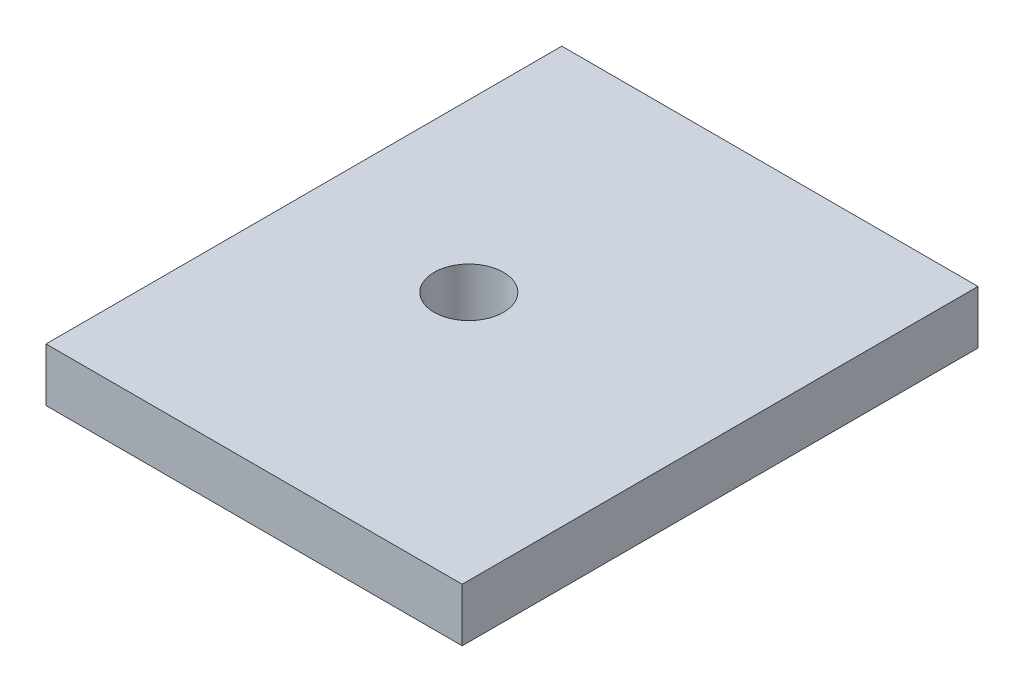
ISO-10303-21;
HEADER;
FILE_DESCRIPTION(('STEP AP214'),'2;1');
FILE_NAME('part.step','',(''),(''),'','','');
FILE_SCHEMA(('AUTOMOTIVE_DESIGN { 1 0 10303 214 1 1 1 1 }'));
ENDSEC;
DATA;
#1=APPLICATION_CONTEXT('core data for automotive mechanical design processes');
#2=APPLICATION_PROTOCOL_DEFINITION('international standard','automotive_design',2000,#1);
#3=PRODUCT_CONTEXT('',#1,'mechanical');
#4=PRODUCT('Part','Part','',(#3));
#5=PRODUCT_RELATED_PRODUCT_CATEGORY('part','',(#4));
#6=PRODUCT_DEFINITION_FORMATION('','',#4);
#7=PRODUCT_DEFINITION_CONTEXT('part definition',#1,'design');
#8=PRODUCT_DEFINITION('design','',#6,#7);
#9=PRODUCT_DEFINITION_SHAPE('','',#8);
#10=(LENGTH_UNIT() NAMED_UNIT(*) SI_UNIT(.MILLI.,.METRE.));
#11=(NAMED_UNIT(*) PLANE_ANGLE_UNIT() SI_UNIT($,.RADIAN.));
#12=(NAMED_UNIT(*) SI_UNIT($,.STERADIAN.) SOLID_ANGLE_UNIT());
#13=UNCERTAINTY_MEASURE_WITH_UNIT(LENGTH_MEASURE(1.E-05),#10,'distance_accuracy_value','');
#14=(GEOMETRIC_REPRESENTATION_CONTEXT(3) GLOBAL_UNCERTAINTY_ASSIGNED_CONTEXT((#13)) GLOBAL_UNIT_ASSIGNED_CONTEXT((#10,
#11,#12)) REPRESENTATION_CONTEXT('',''));
#15=CARTESIAN_POINT('',(0.,0.,0.));
#16=DIRECTION('',(0.,0.,1.));
#17=DIRECTION('',(1.,0.,0.));
#18=AXIS2_PLACEMENT_3D('',#15,#16,#17);
#19=CARTESIAN_POINT('',(0.,3.,0.));
#20=DIRECTION('',(0.,-1.,0.));
#21=DIRECTION('',(0.,0.,-1.));
#22=AXIS2_PLACEMENT_3D('',#19,#20,#21);
#23=PLANE('',#22);
#24=CARTESIAN_POINT('',(-2.32817741662139,3.,0.100000000003458));
#25=DIRECTION('',(0.,1.,0.));
#26=DIRECTION('',(0.,0.,1.));
#27=AXIS2_PLACEMENT_3D('',#24,#25,#26);
#28=CIRCLE('',#27,1.95000000000133);
#29=CARTESIAN_POINT('',(-2.32817741662139,3.,2.05000000000479));
#30=VERTEX_POINT('',#29);
#31=EDGE_CURVE('E99',#30,#30,#28,.T.);
#32=ORIENTED_EDGE('',*,*,#31,.F.);
#33=EDGE_LOOP('',(#32));
#34=FACE_BOUND('',#33,.T.);
#35=DIRECTION('',(0.,0.,-1.));
#36=VECTOR('',#35,1.);
#37=CARTESIAN_POINT('',(11.7,3.,14.5));
#38=LINE('',#37,#36);
#39=CARTESIAN_POINT('',(11.7,3.,14.5));
#40=VERTEX_POINT('',#39);
#41=CARTESIAN_POINT('',(11.7,3.,-14.5));
#42=VERTEX_POINT('',#41);
#43=EDGE_CURVE('E103',#40,#42,#38,.T.);
#44=ORIENTED_EDGE('',*,*,#43,.T.);
#45=DIRECTION('',(-1.,0.,0.));
#46=VECTOR('',#45,1.);
#47=CARTESIAN_POINT('',(-11.7,3.,-14.5));
#48=LINE('',#47,#46);
#49=CARTESIAN_POINT('',(-11.7,3.,-14.5));
#50=VERTEX_POINT('',#49);
#51=EDGE_CURVE('E105',#42,#50,#48,.T.);
#52=ORIENTED_EDGE('',*,*,#51,.T.);
#53=DIRECTION('',(0.,0.,1.));
#54=VECTOR('',#53,1.);
#55=CARTESIAN_POINT('',(-11.7,3.,14.5));
#56=LINE('',#55,#54);
#57=CARTESIAN_POINT('',(-11.7,3.,14.5));
#58=VERTEX_POINT('',#57);
#59=EDGE_CURVE('E44',#50,#58,#56,.T.);
#60=ORIENTED_EDGE('',*,*,#59,.T.);
#61=DIRECTION('',(1.,0.,0.));
#62=VECTOR('',#61,1.);
#63=CARTESIAN_POINT('',(-11.7,3.,14.5));
#64=LINE('',#63,#62);
#65=EDGE_CURVE('E11',#58,#40,#64,.T.);
#66=ORIENTED_EDGE('',*,*,#65,.T.);
#67=EDGE_LOOP('',(#44,#52,#60,#66));
#68=FACE_BOUND('',#67,.T.);
#69=ADVANCED_FACE('F35',(#34,#68),#23,.F.);
#70=CARTESIAN_POINT('',(0.,0.,0.));
#71=DIRECTION('',(0.,-1.,0.));
#72=DIRECTION('',(0.,0.,-1.));
#73=AXIS2_PLACEMENT_3D('',#70,#71,#72);
#74=PLANE('',#73);
#75=CARTESIAN_POINT('',(-2.32817741662139,0.,0.100000000003458));
#76=DIRECTION('',(0.,-1.,0.));
#77=DIRECTION('',(0.,0.,-1.));
#78=AXIS2_PLACEMENT_3D('',#75,#76,#77);
#79=CIRCLE('',#78,1.95000000000133);
#80=CARTESIAN_POINT('',(-2.32817741662139,0.,-1.84999999999787));
#81=VERTEX_POINT('',#80);
#82=EDGE_CURVE('E39',#81,#81,#79,.T.);
#83=ORIENTED_EDGE('',*,*,#82,.F.);
#84=EDGE_LOOP('',(#83));
#85=FACE_BOUND('',#84,.T.);
#86=DIRECTION('',(-1.,0.,0.));
#87=VECTOR('',#86,1.);
#88=CARTESIAN_POINT('',(-11.7,0.,-14.5));
#89=LINE('',#88,#87);
#90=CARTESIAN_POINT('',(11.7,0.,-14.5));
#91=VERTEX_POINT('',#90);
#92=CARTESIAN_POINT('',(-11.7,0.,-14.5));
#93=VERTEX_POINT('',#92);
#94=EDGE_CURVE('E75',#91,#93,#89,.T.);
#95=ORIENTED_EDGE('',*,*,#94,.F.);
#96=DIRECTION('',(0.,0.,-1.));
#97=VECTOR('',#96,1.);
#98=CARTESIAN_POINT('',(11.7,0.,14.5));
#99=LINE('',#98,#97);
#100=CARTESIAN_POINT('',(11.7,0.,14.5));
#101=VERTEX_POINT('',#100);
#102=EDGE_CURVE('E58',#101,#91,#99,.T.);
#103=ORIENTED_EDGE('',*,*,#102,.F.);
#104=DIRECTION('',(1.,0.,0.));
#105=VECTOR('',#104,1.);
#106=CARTESIAN_POINT('',(-11.7,0.,14.5));
#107=LINE('',#106,#105);
#108=CARTESIAN_POINT('',(-11.7,0.,14.5));
#109=VERTEX_POINT('',#108);
#110=EDGE_CURVE('E52',#109,#101,#107,.T.);
#111=ORIENTED_EDGE('',*,*,#110,.F.);
#112=DIRECTION('',(0.,0.,1.));
#113=VECTOR('',#112,1.);
#114=CARTESIAN_POINT('',(-11.7,0.,14.5));
#115=LINE('',#114,#113);
#116=EDGE_CURVE('E72',#93,#109,#115,.T.);
#117=ORIENTED_EDGE('',*,*,#116,.F.);
#118=EDGE_LOOP('',(#95,#103,#111,#117));
#119=FACE_BOUND('',#118,.T.);
#120=ADVANCED_FACE('F74',(#85,#119),#74,.T.);
#121=CARTESIAN_POINT('',(11.7,3.,14.5));
#122=DIRECTION('',(-1.,0.,0.));
#123=DIRECTION('',(0.,0.,1.));
#124=AXIS2_PLACEMENT_3D('',#121,#122,#123);
#125=PLANE('',#124);
#126=ORIENTED_EDGE('',*,*,#102,.T.);
#127=DIRECTION('',(0.,1.,0.));
#128=VECTOR('',#127,1.);
#129=CARTESIAN_POINT('',(11.7,-37.2633868562695,-14.5));
#130=LINE('',#129,#128);
#131=EDGE_CURVE('E88',#91,#42,#130,.T.);
#132=ORIENTED_EDGE('',*,*,#131,.T.);
#133=ORIENTED_EDGE('',*,*,#43,.F.);
#134=DIRECTION('',(0.,1.,0.));
#135=VECTOR('',#134,1.);
#136=CARTESIAN_POINT('',(11.7,-37.2633868562695,14.5));
#137=LINE('',#136,#135);
#138=EDGE_CURVE('E94',#101,#40,#137,.T.);
#139=ORIENTED_EDGE('',*,*,#138,.F.);
#140=EDGE_LOOP('',(#126,#132,#133,#139));
#141=FACE_BOUND('',#140,.T.);
#142=ADVANCED_FACE('F37',(#141),#125,.F.);
#143=CARTESIAN_POINT('',(-11.7,3.,-14.5));
#144=DIRECTION('',(0.,0.,1.));
#145=DIRECTION('',(1.,0.,0.));
#146=AXIS2_PLACEMENT_3D('',#143,#144,#145);
#147=PLANE('',#146);
#148=ORIENTED_EDGE('',*,*,#51,.F.);
#149=ORIENTED_EDGE('',*,*,#131,.F.);
#150=ORIENTED_EDGE('',*,*,#94,.T.);
#151=DIRECTION('',(0.,1.,0.));
#152=VECTOR('',#151,1.);
#153=CARTESIAN_POINT('',(-11.7,-37.2633868562695,-14.5));
#154=LINE('',#153,#152);
#155=EDGE_CURVE('E86',#93,#50,#154,.T.);
#156=ORIENTED_EDGE('',*,*,#155,.T.);
#157=EDGE_LOOP('',(#148,#149,#150,#156));
#158=FACE_BOUND('',#157,.T.);
#159=ADVANCED_FACE('F85',(#158),#147,.F.);
#160=CARTESIAN_POINT('',(-11.7,3.,14.5));
#161=DIRECTION('',(1.,0.,0.));
#162=DIRECTION('',(0.,0.,-1.));
#163=AXIS2_PLACEMENT_3D('',#160,#161,#162);
#164=PLANE('',#163);
#165=ORIENTED_EDGE('',*,*,#116,.T.);
#166=DIRECTION('',(0.,1.,0.));
#167=VECTOR('',#166,1.);
#168=CARTESIAN_POINT('',(-11.7,-37.2633868562695,14.5));
#169=LINE('',#168,#167);
#170=EDGE_CURVE('E92',#109,#58,#169,.T.);
#171=ORIENTED_EDGE('',*,*,#170,.T.);
#172=ORIENTED_EDGE('',*,*,#59,.F.);
#173=ORIENTED_EDGE('',*,*,#155,.F.);
#174=EDGE_LOOP('',(#165,#171,#172,#173));
#175=FACE_BOUND('',#174,.T.);
#176=ADVANCED_FACE('F91',(#175),#164,.F.);
#177=CARTESIAN_POINT('',(-11.7,3.,14.5));
#178=DIRECTION('',(0.,0.,-1.));
#179=DIRECTION('',(-1.,0.,0.));
#180=AXIS2_PLACEMENT_3D('',#177,#178,#179);
#181=PLANE('',#180);
#182=ORIENTED_EDGE('',*,*,#110,.T.);
#183=ORIENTED_EDGE('',*,*,#138,.T.);
#184=ORIENTED_EDGE('',*,*,#65,.F.);
#185=ORIENTED_EDGE('',*,*,#170,.F.);
#186=EDGE_LOOP('',(#182,#183,#184,#185));
#187=FACE_BOUND('',#186,.T.);
#188=ADVANCED_FACE('F110',(#187),#181,.F.);
#189=CARTESIAN_POINT('',(-2.32817741662139,-7.,0.100000000003458));
#190=DIRECTION('',(0.,1.,0.));
#191=DIRECTION('',(0.,0.,1.));
#192=AXIS2_PLACEMENT_3D('',#189,#190,#191);
#193=CYLINDRICAL_SURFACE('',#192,1.95000000000133);
#194=ORIENTED_EDGE('',*,*,#82,.T.);
#195=EDGE_LOOP('',(#194));
#196=FACE_BOUND('',#195,.T.);
#197=ORIENTED_EDGE('',*,*,#31,.T.);
#198=EDGE_LOOP('',(#197));
#199=FACE_BOUND('',#198,.T.);
#200=ADVANCED_FACE('F125',(#196,#199),#193,.F.);
#201=CLOSED_SHELL('',(#69,#120,#142,#159,#176,#188,#200));
#202=MANIFOLD_SOLID_BREP('B2',#201);
#203=ADVANCED_BREP_SHAPE_REPRESENTATION('',(#18,#202),#14);
#204=SHAPE_DEFINITION_REPRESENTATION(#9,#203);
ENDSEC;
END-ISO-10303-21;
